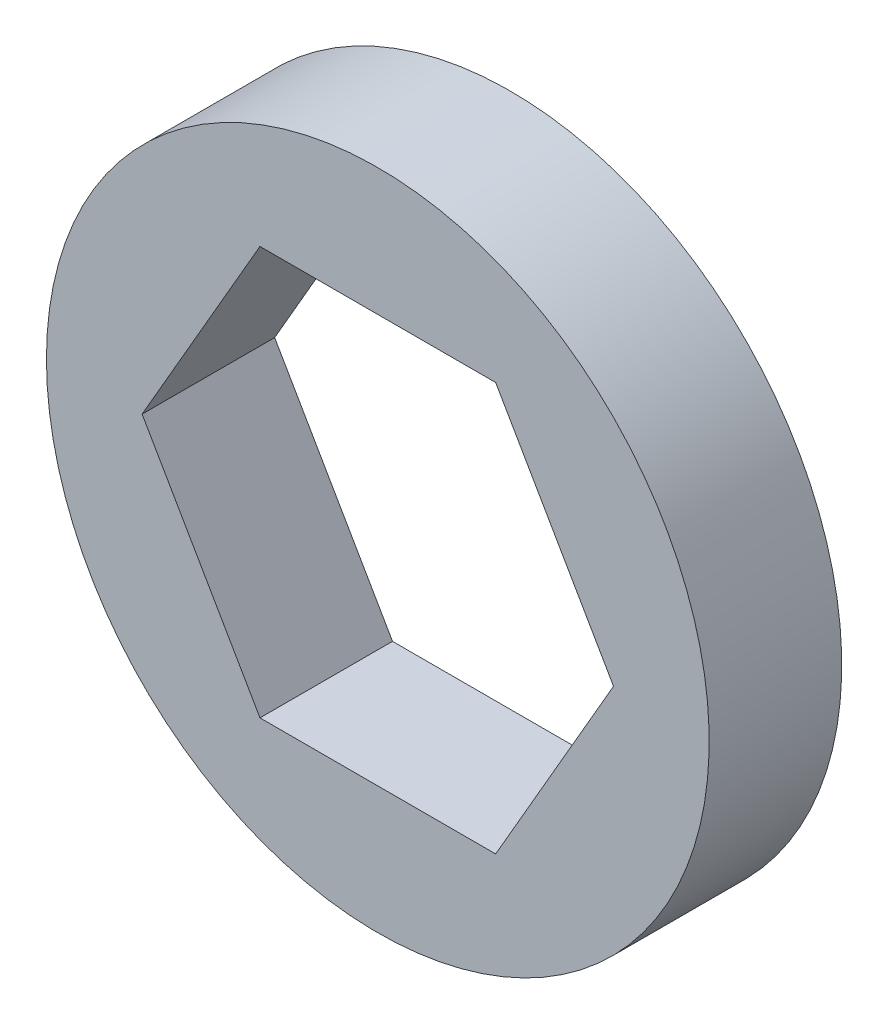
ISO-10303-21;
HEADER;
FILE_DESCRIPTION(('STEP AP214'),'2;1');
FILE_NAME('part.step','',(''),(''),'','','');
FILE_SCHEMA(('AUTOMOTIVE_DESIGN { 1 0 10303 214 1 1 1 1 }'));
ENDSEC;
DATA;
#1=APPLICATION_CONTEXT('core data for automotive mechanical design processes');
#2=APPLICATION_PROTOCOL_DEFINITION('international standard','automotive_design',2000,#1);
#3=PRODUCT_CONTEXT('',#1,'mechanical');
#4=PRODUCT('Part','Part','',(#3));
#5=PRODUCT_RELATED_PRODUCT_CATEGORY('part','',(#4));
#6=PRODUCT_DEFINITION_FORMATION('','',#4);
#7=PRODUCT_DEFINITION_CONTEXT('part definition',#1,'design');
#8=PRODUCT_DEFINITION('design','',#6,#7);
#9=PRODUCT_DEFINITION_SHAPE('','',#8);
#10=(LENGTH_UNIT() NAMED_UNIT(*) SI_UNIT(.MILLI.,.METRE.));
#11=(NAMED_UNIT(*) PLANE_ANGLE_UNIT() SI_UNIT($,.RADIAN.));
#12=(NAMED_UNIT(*) SI_UNIT($,.STERADIAN.) SOLID_ANGLE_UNIT());
#13=UNCERTAINTY_MEASURE_WITH_UNIT(LENGTH_MEASURE(1.E-05),#10,'distance_accuracy_value','');
#14=(GEOMETRIC_REPRESENTATION_CONTEXT(3) GLOBAL_UNCERTAINTY_ASSIGNED_CONTEXT((#13)) GLOBAL_UNIT_ASSIGNED_CONTEXT((#10,
#11,#12)) REPRESENTATION_CONTEXT('',''));
#15=CARTESIAN_POINT('',(0.,0.,0.));
#16=DIRECTION('',(0.,0.,1.));
#17=DIRECTION('',(1.,0.,0.));
#18=AXIS2_PLACEMENT_3D('',#15,#16,#17);
#19=CARTESIAN_POINT('',(0.,0.,-1.5875));
#20=DIRECTION('',(0.,0.,1.));
#21=DIRECTION('',(1.,0.,0.));
#22=AXIS2_PLACEMENT_3D('',#19,#20,#21);
#23=PLANE('',#22);
#24=DIRECTION('',(-0.5,-0.866025403784439,0.));
#25=VECTOR('',#24,1.);
#26=CARTESIAN_POINT('',(2.82295414120268,-4.8895,-1.5875));
#27=LINE('',#26,#25);
#28=CARTESIAN_POINT('',(5.64590828240535,0.,-1.5875));
#29=VERTEX_POINT('',#28);
#30=CARTESIAN_POINT('',(2.82295414120268,-4.8895,-1.5875));
#31=VERTEX_POINT('',#30);
#32=EDGE_CURVE('E72',#29,#31,#27,.T.);
#33=ORIENTED_EDGE('',*,*,#32,.F.);
#34=DIRECTION('',(0.500000000000001,-0.866025403784438,0.));
#35=VECTOR('',#34,1.);
#36=CARTESIAN_POINT('',(5.64590828240535,0.,-1.5875));
#37=LINE('',#36,#35);
#38=CARTESIAN_POINT('',(2.82295414120267,4.8895,-1.5875));
#39=VERTEX_POINT('',#38);
#40=EDGE_CURVE('E102',#39,#29,#37,.T.);
#41=ORIENTED_EDGE('',*,*,#40,.F.);
#42=DIRECTION('',(1.,0.,0.));
#43=VECTOR('',#42,1.);
#44=CARTESIAN_POINT('',(2.82295414120267,4.8895,-1.5875));
#45=LINE('',#44,#43);
#46=CARTESIAN_POINT('',(-2.82295414120268,4.8895,-1.5875));
#47=VERTEX_POINT('',#46);
#48=EDGE_CURVE('E110',#47,#39,#45,.T.);
#49=ORIENTED_EDGE('',*,*,#48,.F.);
#50=DIRECTION('',(0.5,0.866025403784439,0.));
#51=VECTOR('',#50,1.);
#52=CARTESIAN_POINT('',(-2.82295414120268,4.8895,-1.5875));
#53=LINE('',#52,#51);
#54=CARTESIAN_POINT('',(-5.64590828240535,0.,-1.5875));
#55=VERTEX_POINT('',#54);
#56=EDGE_CURVE('E115',#55,#47,#53,.T.);
#57=ORIENTED_EDGE('',*,*,#56,.F.);
#58=DIRECTION('',(-0.5,0.866025403784439,0.));
#59=VECTOR('',#58,1.);
#60=CARTESIAN_POINT('',(-5.64590828240535,0.,-1.5875));
#61=LINE('',#60,#59);
#62=CARTESIAN_POINT('',(-2.82295414120268,-4.8895,-1.5875));
#63=VERTEX_POINT('',#62);
#64=EDGE_CURVE('E67',#63,#55,#61,.T.);
#65=ORIENTED_EDGE('',*,*,#64,.F.);
#66=DIRECTION('',(-1.,0.,0.));
#67=VECTOR('',#66,1.);
#68=CARTESIAN_POINT('',(-2.82295414120268,-4.8895,-1.5875));
#69=LINE('',#68,#67);
#70=EDGE_CURVE('E69',#31,#63,#69,.T.);
#71=ORIENTED_EDGE('',*,*,#70,.F.);
#72=EDGE_LOOP('',(#33,#41,#49,#57,#65,#71));
#73=FACE_BOUND('',#72,.T.);
#74=CARTESIAN_POINT('',(0.,0.,-1.5875));
#75=DIRECTION('',(0.,0.,-1.));
#76=DIRECTION('',(-1.,0.,0.));
#77=AXIS2_PLACEMENT_3D('',#74,#75,#76);
#78=CIRCLE('',#77,7.9375);
#79=CARTESIAN_POINT('',(-7.9375,0.,-1.5875));
#80=VERTEX_POINT('',#79);
#81=EDGE_CURVE('E19',#80,#80,#78,.F.);
#82=ORIENTED_EDGE('',*,*,#81,.F.);
#83=EDGE_LOOP('',(#82));
#84=FACE_BOUND('',#83,.T.);
#85=ADVANCED_FACE('F16',(#73,#84),#23,.F.);
#86=CARTESIAN_POINT('',(0.,0.,1.5875));
#87=DIRECTION('',(0.,0.,-1.));
#88=DIRECTION('',(-1.,0.,0.));
#89=AXIS2_PLACEMENT_3D('',#86,#87,#88);
#90=CYLINDRICAL_SURFACE('',#89,7.9375);
#91=ORIENTED_EDGE('',*,*,#81,.T.);
#92=EDGE_LOOP('',(#91));
#93=FACE_BOUND('',#92,.T.);
#94=CARTESIAN_POINT('',(0.,0.,1.5875));
#95=DIRECTION('',(0.,0.,-1.));
#96=DIRECTION('',(-1.,0.,0.));
#97=AXIS2_PLACEMENT_3D('',#94,#95,#96);
#98=CIRCLE('',#97,7.9375);
#99=CARTESIAN_POINT('',(-7.9375,0.,1.5875));
#100=VERTEX_POINT('',#99);
#101=EDGE_CURVE('E94',#100,#100,#98,.F.);
#102=ORIENTED_EDGE('',*,*,#101,.F.);
#103=EDGE_LOOP('',(#102));
#104=FACE_BOUND('',#103,.T.);
#105=ADVANCED_FACE('F152',(#93,#104),#90,.T.);
#106=CARTESIAN_POINT('',(2.82295414120268,-4.8895,1.5875));
#107=DIRECTION('',(-0.866025403784439,0.5,0.));
#108=DIRECTION('',(-0.5,-0.866025403784439,0.));
#109=AXIS2_PLACEMENT_3D('',#106,#107,#108);
#110=PLANE('',#109);
#111=DIRECTION('',(-0.5,-0.866025403784439,0.));
#112=VECTOR('',#111,1.);
#113=CARTESIAN_POINT('',(5.64590828240535,0.,1.5875));
#114=LINE('',#113,#112);
#115=CARTESIAN_POINT('',(5.64590828240535,0.,1.5875));
#116=VERTEX_POINT('',#115);
#117=CARTESIAN_POINT('',(2.82295414120268,-4.8895,1.5875));
#118=VERTEX_POINT('',#117);
#119=EDGE_CURVE('E96',#116,#118,#114,.T.);
#120=ORIENTED_EDGE('',*,*,#119,.F.);
#121=DIRECTION('',(0.,0.,1.));
#122=VECTOR('',#121,1.);
#123=CARTESIAN_POINT('',(5.64590828240535,0.,1.5875));
#124=LINE('',#123,#122);
#125=EDGE_CURVE('E83',#29,#116,#124,.T.);
#126=ORIENTED_EDGE('',*,*,#125,.F.);
#127=ORIENTED_EDGE('',*,*,#32,.T.);
#128=DIRECTION('',(0.,0.,1.));
#129=VECTOR('',#128,1.);
#130=CARTESIAN_POINT('',(2.82295414120268,-4.8895,1.5875));
#131=LINE('',#130,#129);
#132=EDGE_CURVE('E77',#118,#31,#131,.F.);
#133=ORIENTED_EDGE('',*,*,#132,.F.);
#134=EDGE_LOOP('',(#120,#126,#127,#133));
#135=FACE_BOUND('',#134,.T.);
#136=ADVANCED_FACE('F80',(#135),#110,.T.);
#137=CARTESIAN_POINT('',(-2.82295414120268,-4.8895,1.5875));
#138=DIRECTION('',(0.,1.,0.));
#139=DIRECTION('',(-1.,0.,0.));
#140=AXIS2_PLACEMENT_3D('',#137,#138,#139);
#141=PLANE('',#140);
#142=DIRECTION('',(1.,0.,0.));
#143=VECTOR('',#142,1.);
#144=CARTESIAN_POINT('',(0.,-4.8895,1.5875));
#145=LINE('',#144,#143);
#146=CARTESIAN_POINT('',(-2.82295414120268,-4.8895,1.5875));
#147=VERTEX_POINT('',#146);
#148=EDGE_CURVE('E88',#118,#147,#145,.F.);
#149=ORIENTED_EDGE('',*,*,#148,.F.);
#150=ORIENTED_EDGE('',*,*,#132,.T.);
#151=ORIENTED_EDGE('',*,*,#70,.T.);
#152=DIRECTION('',(0.,0.,1.));
#153=VECTOR('',#152,1.);
#154=CARTESIAN_POINT('',(-2.82295414120268,-4.8895,1.5875));
#155=LINE('',#154,#153);
#156=EDGE_CURVE('E91',#147,#63,#155,.F.);
#157=ORIENTED_EDGE('',*,*,#156,.F.);
#158=EDGE_LOOP('',(#149,#150,#151,#157));
#159=FACE_BOUND('',#158,.T.);
#160=ADVANCED_FACE('F86',(#159),#141,.T.);
#161=CARTESIAN_POINT('',(-5.64590828240535,0.,1.5875));
#162=DIRECTION('',(0.866025403784439,0.5,0.));
#163=DIRECTION('',(-0.5,0.866025403784439,0.));
#164=AXIS2_PLACEMENT_3D('',#161,#162,#163);
#165=PLANE('',#164);
#166=DIRECTION('',(-0.5,0.866025403784439,0.));
#167=VECTOR('',#166,1.);
#168=CARTESIAN_POINT('',(-2.82295414120268,-4.8895,1.5875));
#169=LINE('',#168,#167);
#170=CARTESIAN_POINT('',(-5.64590828240535,0.,1.5875));
#171=VERTEX_POINT('',#170);
#172=EDGE_CURVE('E121',#147,#171,#169,.T.);
#173=ORIENTED_EDGE('',*,*,#172,.F.);
#174=ORIENTED_EDGE('',*,*,#156,.T.);
#175=ORIENTED_EDGE('',*,*,#64,.T.);
#176=DIRECTION('',(0.,0.,1.));
#177=VECTOR('',#176,1.);
#178=CARTESIAN_POINT('',(-5.64590828240535,0.,1.5875));
#179=LINE('',#178,#177);
#180=EDGE_CURVE('E112',#171,#55,#179,.F.);
#181=ORIENTED_EDGE('',*,*,#180,.F.);
#182=EDGE_LOOP('',(#173,#174,#175,#181));
#183=FACE_BOUND('',#182,.T.);
#184=ADVANCED_FACE('F119',(#183),#165,.T.);
#185=CARTESIAN_POINT('',(-2.82295414120268,4.8895,1.5875));
#186=DIRECTION('',(0.866025403784439,-0.5,0.));
#187=DIRECTION('',(0.5,0.866025403784439,0.));
#188=AXIS2_PLACEMENT_3D('',#185,#186,#187);
#189=PLANE('',#188);
#190=DIRECTION('',(0.5,0.866025403784439,0.));
#191=VECTOR('',#190,1.);
#192=CARTESIAN_POINT('',(-5.64590828240535,0.,1.5875));
#193=LINE('',#192,#191);
#194=CARTESIAN_POINT('',(-2.82295414120268,4.8895,1.5875));
#195=VERTEX_POINT('',#194);
#196=EDGE_CURVE('E125',#171,#195,#193,.T.);
#197=ORIENTED_EDGE('',*,*,#196,.F.);
#198=ORIENTED_EDGE('',*,*,#180,.T.);
#199=ORIENTED_EDGE('',*,*,#56,.T.);
#200=DIRECTION('',(0.,0.,1.));
#201=VECTOR('',#200,1.);
#202=CARTESIAN_POINT('',(-2.82295414120268,4.8895,1.5875));
#203=LINE('',#202,#201);
#204=EDGE_CURVE('E107',#195,#47,#203,.F.);
#205=ORIENTED_EDGE('',*,*,#204,.F.);
#206=EDGE_LOOP('',(#197,#198,#199,#205));
#207=FACE_BOUND('',#206,.T.);
#208=ADVANCED_FACE('F133',(#207),#189,.T.);
#209=CARTESIAN_POINT('',(2.82295414120267,4.8895,1.5875));
#210=DIRECTION('',(0.,-1.,0.));
#211=DIRECTION('',(1.,0.,0.));
#212=AXIS2_PLACEMENT_3D('',#209,#210,#211);
#213=PLANE('',#212);
#214=DIRECTION('',(1.,0.,0.));
#215=VECTOR('',#214,1.);
#216=CARTESIAN_POINT('',(0.,4.8895,1.5875));
#217=LINE('',#216,#215);
#218=CARTESIAN_POINT('',(2.82295414120267,4.8895,1.5875));
#219=VERTEX_POINT('',#218);
#220=EDGE_CURVE('E25',#195,#219,#217,.T.);
#221=ORIENTED_EDGE('',*,*,#220,.F.);
#222=ORIENTED_EDGE('',*,*,#204,.T.);
#223=ORIENTED_EDGE('',*,*,#48,.T.);
#224=DIRECTION('',(0.,0.,1.));
#225=VECTOR('',#224,1.);
#226=CARTESIAN_POINT('',(2.82295414120267,4.8895,1.5875));
#227=LINE('',#226,#225);
#228=EDGE_CURVE('E34',#219,#39,#227,.F.);
#229=ORIENTED_EDGE('',*,*,#228,.F.);
#230=EDGE_LOOP('',(#221,#222,#223,#229));
#231=FACE_BOUND('',#230,.T.);
#232=ADVANCED_FACE('F131',(#231),#213,.T.);
#233=CARTESIAN_POINT('',(5.64590828240535,0.,1.5875));
#234=DIRECTION('',(-0.866025403784438,-0.500000000000001,0.));
#235=DIRECTION('',(0.500000000000001,-0.866025403784438,0.));
#236=AXIS2_PLACEMENT_3D('',#233,#234,#235);
#237=PLANE('',#236);
#238=DIRECTION('',(0.5,-0.866025403784438,0.));
#239=VECTOR('',#238,1.);
#240=CARTESIAN_POINT('',(2.82295414120267,4.8895,1.5875));
#241=LINE('',#240,#239);
#242=EDGE_CURVE('E11',#219,#116,#241,.T.);
#243=ORIENTED_EDGE('',*,*,#242,.F.);
#244=ORIENTED_EDGE('',*,*,#228,.T.);
#245=ORIENTED_EDGE('',*,*,#40,.T.);
#246=ORIENTED_EDGE('',*,*,#125,.T.);
#247=EDGE_LOOP('',(#243,#244,#245,#246));
#248=FACE_BOUND('',#247,.T.);
#249=ADVANCED_FACE('F134',(#248),#237,.T.);
#250=CARTESIAN_POINT('',(0.,0.,1.5875));
#251=DIRECTION('',(0.,0.,1.));
#252=DIRECTION('',(1.,0.,0.));
#253=AXIS2_PLACEMENT_3D('',#250,#251,#252);
#254=PLANE('',#253);
#255=ORIENTED_EDGE('',*,*,#220,.T.);
#256=ORIENTED_EDGE('',*,*,#242,.T.);
#257=ORIENTED_EDGE('',*,*,#119,.T.);
#258=ORIENTED_EDGE('',*,*,#148,.T.);
#259=ORIENTED_EDGE('',*,*,#172,.T.);
#260=ORIENTED_EDGE('',*,*,#196,.T.);
#261=EDGE_LOOP('',(#255,#256,#257,#258,#259,#260));
#262=FACE_BOUND('',#261,.T.);
#263=ORIENTED_EDGE('',*,*,#101,.T.);
#264=EDGE_LOOP('',(#263));
#265=FACE_BOUND('',#264,.T.);
#266=ADVANCED_FACE('F128',(#262,#265),#254,.T.);
#267=CLOSED_SHELL('',(#85,#105,#136,#160,#184,#208,#232,#249,#266));
#268=MANIFOLD_SOLID_BREP('B1',#267);
#269=ADVANCED_BREP_SHAPE_REPRESENTATION('',(#18,#268),#14);
#270=SHAPE_DEFINITION_REPRESENTATION(#9,#269);
ENDSEC;
END-ISO-10303-21;
